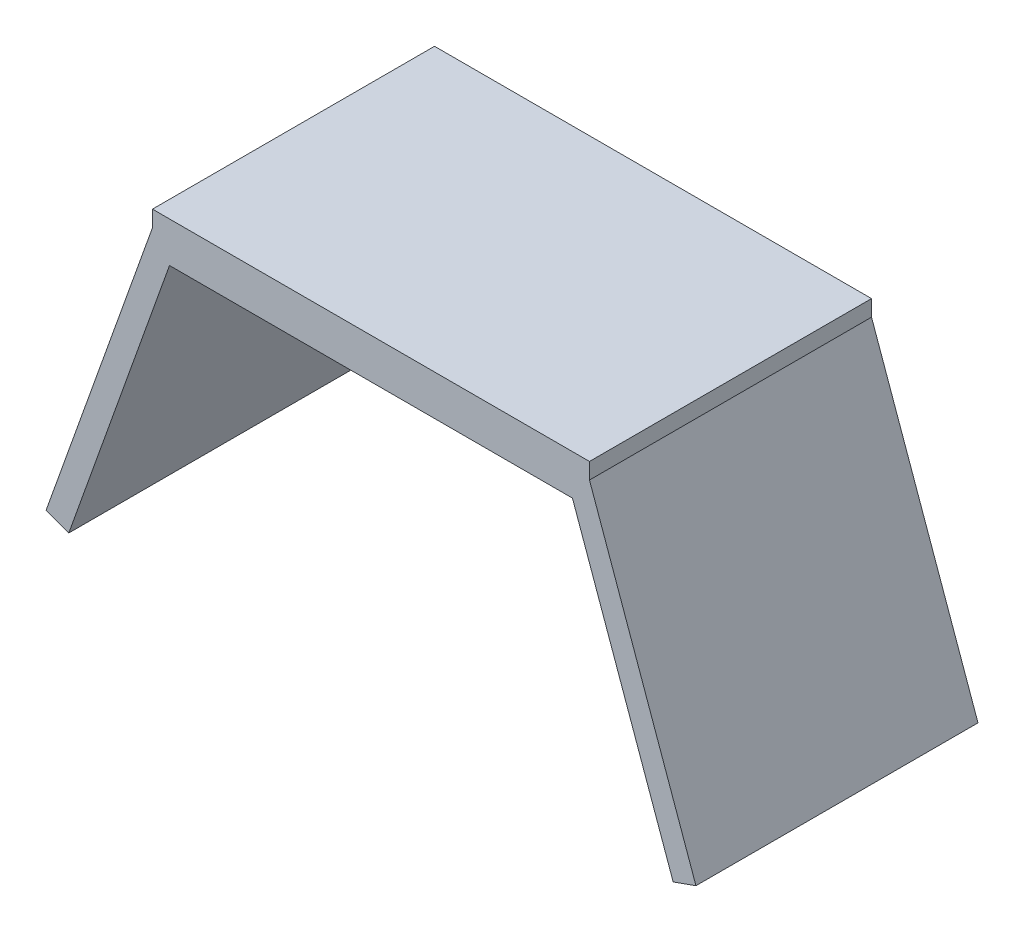
ISO-10303-21;
HEADER;
FILE_DESCRIPTION(('STEP AP214'),'2;1');
FILE_NAME('part.step','',(''),(''),'','','');
FILE_SCHEMA(('AUTOMOTIVE_DESIGN { 1 0 10303 214 1 1 1 1 }'));
ENDSEC;
DATA;
#1=APPLICATION_CONTEXT('core data for automotive mechanical design processes');
#2=APPLICATION_PROTOCOL_DEFINITION('international standard','automotive_design',2000,#1);
#3=PRODUCT_CONTEXT('',#1,'mechanical');
#4=PRODUCT('Part','Part','',(#3));
#5=PRODUCT_RELATED_PRODUCT_CATEGORY('part','',(#4));
#6=PRODUCT_DEFINITION_FORMATION('','',#4);
#7=PRODUCT_DEFINITION_CONTEXT('part definition',#1,'design');
#8=PRODUCT_DEFINITION('design','',#6,#7);
#9=PRODUCT_DEFINITION_SHAPE('','',#8);
#10=(LENGTH_UNIT() NAMED_UNIT(*) SI_UNIT(.MILLI.,.METRE.));
#11=(NAMED_UNIT(*) PLANE_ANGLE_UNIT() SI_UNIT($,.RADIAN.));
#12=(NAMED_UNIT(*) SI_UNIT($,.STERADIAN.) SOLID_ANGLE_UNIT());
#13=UNCERTAINTY_MEASURE_WITH_UNIT(LENGTH_MEASURE(1.E-05),#10,'distance_accuracy_value','');
#14=(GEOMETRIC_REPRESENTATION_CONTEXT(3) GLOBAL_UNCERTAINTY_ASSIGNED_CONTEXT((#13)) GLOBAL_UNIT_ASSIGNED_CONTEXT((#10,
#11,#12)) REPRESENTATION_CONTEXT('',''));
#15=CARTESIAN_POINT('',(0.,0.,0.));
#16=DIRECTION('',(0.,0.,1.));
#17=DIRECTION('',(1.,0.,0.));
#18=AXIS2_PLACEMENT_3D('',#15,#16,#17);
#19=CARTESIAN_POINT('',(27.1141575887111,3.,35.));
#20=DIRECTION('',(-1.,0.,0.));
#21=DIRECTION('',(0.,-1.,0.));
#22=AXIS2_PLACEMENT_3D('',#19,#20,#21);
#23=PLANE('',#22);
#24=DIRECTION('',(0.,1.,0.));
#25=VECTOR('',#24,1.);
#26=CARTESIAN_POINT('',(27.1141575887111,3.,0.));
#27=LINE('',#26,#25);
#28=CARTESIAN_POINT('',(27.1141575887111,3.,0.));
#29=VERTEX_POINT('',#28);
#30=CARTESIAN_POINT('',(27.1141575887111,5.,0.));
#31=VERTEX_POINT('',#30);
#32=EDGE_CURVE('E144',#29,#31,#27,.T.);
#33=ORIENTED_EDGE('',*,*,#32,.T.);
#34=DIRECTION('',(0.,0.,-1.));
#35=VECTOR('',#34,1.);
#36=CARTESIAN_POINT('',(27.1141575887111,5.,35.));
#37=LINE('',#36,#35);
#38=CARTESIAN_POINT('',(27.1141575887111,5.,35.));
#39=VERTEX_POINT('',#38);
#40=EDGE_CURVE('E11',#39,#31,#37,.T.);
#41=ORIENTED_EDGE('',*,*,#40,.F.);
#42=DIRECTION('',(0.,1.,0.));
#43=VECTOR('',#42,1.);
#44=CARTESIAN_POINT('',(27.1141575887111,3.,35.));
#45=LINE('',#44,#43);
#46=CARTESIAN_POINT('',(27.1141575887111,3.,35.));
#47=VERTEX_POINT('',#46);
#48=EDGE_CURVE('E162',#47,#39,#45,.T.);
#49=ORIENTED_EDGE('',*,*,#48,.F.);
#50=DIRECTION('',(0.,0.,-1.));
#51=VECTOR('',#50,1.);
#52=CARTESIAN_POINT('',(27.1141575887111,3.,35.));
#53=LINE('',#52,#51);
#54=EDGE_CURVE('E140',#47,#29,#53,.T.);
#55=ORIENTED_EDGE('',*,*,#54,.T.);
#56=EDGE_LOOP('',(#33,#41,#49,#55));
#57=FACE_BOUND('',#56,.T.);
#58=ADVANCED_FACE('F36',(#57),#23,.F.);
#59=CARTESIAN_POINT('',(-27.1141575887111,5.,35.));
#60=DIRECTION('',(0.,-1.,0.));
#61=DIRECTION('',(0.,0.,-1.));
#62=AXIS2_PLACEMENT_3D('',#59,#60,#61);
#63=PLANE('',#62);
#64=DIRECTION('',(-1.,0.,0.));
#65=VECTOR('',#64,1.);
#66=CARTESIAN_POINT('',(-27.1141575887111,5.,0.));
#67=LINE('',#66,#65);
#68=CARTESIAN_POINT('',(-27.1141575887111,5.,0.));
#69=VERTEX_POINT('',#68);
#70=EDGE_CURVE('E147',#31,#69,#67,.T.);
#71=ORIENTED_EDGE('',*,*,#70,.T.);
#72=DIRECTION('',(0.,0.,-1.));
#73=VECTOR('',#72,1.);
#74=CARTESIAN_POINT('',(-27.1141575887111,5.,35.));
#75=LINE('',#74,#73);
#76=CARTESIAN_POINT('',(-27.1141575887111,5.,35.));
#77=VERTEX_POINT('',#76);
#78=EDGE_CURVE('E44',#77,#69,#75,.T.);
#79=ORIENTED_EDGE('',*,*,#78,.F.);
#80=DIRECTION('',(-1.,0.,0.));
#81=VECTOR('',#80,1.);
#82=CARTESIAN_POINT('',(-27.1141575887111,5.,35.));
#83=LINE('',#82,#81);
#84=EDGE_CURVE('E101',#39,#77,#83,.T.);
#85=ORIENTED_EDGE('',*,*,#84,.F.);
#86=ORIENTED_EDGE('',*,*,#40,.T.);
#87=EDGE_LOOP('',(#71,#79,#85,#86));
#88=FACE_BOUND('',#87,.T.);
#89=ADVANCED_FACE('F211',(#88),#63,.F.);
#90=CARTESIAN_POINT('',(-27.1141575887111,3.,35.));
#91=DIRECTION('',(1.,0.,0.));
#92=DIRECTION('',(0.,0.,-1.));
#93=AXIS2_PLACEMENT_3D('',#90,#91,#92);
#94=PLANE('',#93);
#95=DIRECTION('',(0.,-1.,0.));
#96=VECTOR('',#95,1.);
#97=CARTESIAN_POINT('',(-27.1141575887111,3.,0.));
#98=LINE('',#97,#96);
#99=CARTESIAN_POINT('',(-27.1141575887111,3.,0.));
#100=VERTEX_POINT('',#99);
#101=EDGE_CURVE('E149',#69,#100,#98,.T.);
#102=ORIENTED_EDGE('',*,*,#101,.T.);
#103=DIRECTION('',(0.,0.,-1.));
#104=VECTOR('',#103,1.);
#105=CARTESIAN_POINT('',(-27.1141575887111,3.,35.));
#106=LINE('',#105,#104);
#107=CARTESIAN_POINT('',(-27.1141575887111,3.,35.));
#108=VERTEX_POINT('',#107);
#109=EDGE_CURVE('E175',#108,#100,#106,.T.);
#110=ORIENTED_EDGE('',*,*,#109,.F.);
#111=DIRECTION('',(0.,-1.,0.));
#112=VECTOR('',#111,1.);
#113=CARTESIAN_POINT('',(-27.1141575887111,3.,35.));
#114=LINE('',#113,#112);
#115=EDGE_CURVE('E183',#77,#108,#114,.T.);
#116=ORIENTED_EDGE('',*,*,#115,.F.);
#117=ORIENTED_EDGE('',*,*,#78,.T.);
#118=EDGE_LOOP('',(#102,#110,#116,#117));
#119=FACE_BOUND('',#118,.T.);
#120=ADVANCED_FACE('F181',(#119),#94,.F.);
#121=CARTESIAN_POINT('',(-27.1141575887111,3.,35.));
#122=DIRECTION('',(0.941741911594838,-0.336336396998156,0.));
#123=DIRECTION('',(0.336336396998156,0.941741911594838,0.));
#124=AXIS2_PLACEMENT_3D('',#121,#122,#123);
#125=PLANE('',#124);
#126=DIRECTION('',(-0.336336396998156,-0.941741911594837,0.));
#127=VECTOR('',#126,1.);
#128=CARTESIAN_POINT('',(-27.1141575887111,3.,0.));
#129=LINE('',#128,#127);
#130=CARTESIAN_POINT('',(-40.3252257347845,-33.9909908090055,0.));
#131=VERTEX_POINT('',#130);
#132=EDGE_CURVE('E151',#100,#131,#129,.T.);
#133=ORIENTED_EDGE('',*,*,#132,.T.);
#134=DIRECTION('',(0.,0.,-1.));
#135=VECTOR('',#134,1.);
#136=CARTESIAN_POINT('',(-40.3252257347845,-33.9909908090055,35.));
#137=LINE('',#136,#135);
#138=CARTESIAN_POINT('',(-40.3252257347845,-33.9909908090055,35.));
#139=VERTEX_POINT('',#138);
#140=EDGE_CURVE('E172',#139,#131,#137,.T.);
#141=ORIENTED_EDGE('',*,*,#140,.F.);
#142=DIRECTION('',(-0.336336396998156,-0.941741911594837,0.));
#143=VECTOR('',#142,1.);
#144=CARTESIAN_POINT('',(-27.1141575887111,3.,35.));
#145=LINE('',#144,#143);
#146=EDGE_CURVE('E201',#108,#139,#145,.T.);
#147=ORIENTED_EDGE('',*,*,#146,.F.);
#148=ORIENTED_EDGE('',*,*,#109,.T.);
#149=EDGE_LOOP('',(#133,#141,#147,#148));
#150=FACE_BOUND('',#149,.T.);
#151=ADVANCED_FACE('F192',(#150),#125,.F.);
#152=CARTESIAN_POINT('',(-37.5,-35.,35.));
#153=DIRECTION('',(0.336336396998154,0.941741911594838,0.));
#154=DIRECTION('',(-0.941741911594838,0.336336396998154,0.));
#155=AXIS2_PLACEMENT_3D('',#152,#153,#154);
#156=PLANE('',#155);
#157=DIRECTION('',(0.941741911594838,-0.336336396998154,0.));
#158=VECTOR('',#157,1.);
#159=CARTESIAN_POINT('',(-37.5,-35.,0.));
#160=LINE('',#159,#158);
#161=CARTESIAN_POINT('',(-37.5,-35.,0.));
#162=VERTEX_POINT('',#161);
#163=EDGE_CURVE('E153',#131,#162,#160,.T.);
#164=ORIENTED_EDGE('',*,*,#163,.T.);
#165=DIRECTION('',(0.,0.,-1.));
#166=VECTOR('',#165,1.);
#167=CARTESIAN_POINT('',(-37.5,-35.,35.));
#168=LINE('',#167,#166);
#169=CARTESIAN_POINT('',(-37.5,-35.,35.));
#170=VERTEX_POINT('',#169);
#171=EDGE_CURVE('E169',#170,#162,#168,.T.);
#172=ORIENTED_EDGE('',*,*,#171,.F.);
#173=DIRECTION('',(0.941741911594838,-0.336336396998154,0.));
#174=VECTOR('',#173,1.);
#175=CARTESIAN_POINT('',(-37.5,-35.,35.));
#176=LINE('',#175,#174);
#177=EDGE_CURVE('E198',#139,#170,#176,.T.);
#178=ORIENTED_EDGE('',*,*,#177,.F.);
#179=ORIENTED_EDGE('',*,*,#140,.T.);
#180=EDGE_LOOP('',(#164,#172,#178,#179));
#181=FACE_BOUND('',#180,.T.);
#182=ADVANCED_FACE('F196',(#181),#156,.F.);
#183=CARTESIAN_POINT('',(-25.,0.,35.));
#184=DIRECTION('',(-0.941741911594838,0.336336396998156,0.));
#185=DIRECTION('',(-0.336336396998156,-0.941741911594838,0.));
#186=AXIS2_PLACEMENT_3D('',#183,#184,#185);
#187=PLANE('',#186);
#188=DIRECTION('',(0.336336396998156,0.941741911594838,0.));
#189=VECTOR('',#188,1.);
#190=CARTESIAN_POINT('',(-25.,0.,0.));
#191=LINE('',#190,#189);
#192=CARTESIAN_POINT('',(-25.,0.,0.));
#193=VERTEX_POINT('',#192);
#194=EDGE_CURVE('E155',#162,#193,#191,.T.);
#195=ORIENTED_EDGE('',*,*,#194,.T.);
#196=DIRECTION('',(0.,0.,-1.));
#197=VECTOR('',#196,1.);
#198=CARTESIAN_POINT('',(-25.,0.,35.));
#199=LINE('',#198,#197);
#200=CARTESIAN_POINT('',(-25.,0.,35.));
#201=VERTEX_POINT('',#200);
#202=EDGE_CURVE('E166',#201,#193,#199,.T.);
#203=ORIENTED_EDGE('',*,*,#202,.F.);
#204=DIRECTION('',(0.336336396998156,0.941741911594838,0.));
#205=VECTOR('',#204,1.);
#206=CARTESIAN_POINT('',(-25.,0.,35.));
#207=LINE('',#206,#205);
#208=EDGE_CURVE('E200',#170,#201,#207,.T.);
#209=ORIENTED_EDGE('',*,*,#208,.F.);
#210=ORIENTED_EDGE('',*,*,#171,.T.);
#211=EDGE_LOOP('',(#195,#203,#209,#210));
#212=FACE_BOUND('',#211,.T.);
#213=ADVANCED_FACE('F223',(#212),#187,.F.);
#214=CARTESIAN_POINT('',(-25.,0.,35.));
#215=DIRECTION('',(0.,1.,0.));
#216=DIRECTION('',(0.,0.,1.));
#217=AXIS2_PLACEMENT_3D('',#214,#215,#216);
#218=PLANE('',#217);
#219=DIRECTION('',(1.,0.,0.));
#220=VECTOR('',#219,1.);
#221=CARTESIAN_POINT('',(-25.,0.,0.));
#222=LINE('',#221,#220);
#223=CARTESIAN_POINT('',(25.,0.,0.));
#224=VERTEX_POINT('',#223);
#225=EDGE_CURVE('E157',#193,#224,#222,.T.);
#226=ORIENTED_EDGE('',*,*,#225,.T.);
#227=DIRECTION('',(0.,0.,-1.));
#228=VECTOR('',#227,1.);
#229=CARTESIAN_POINT('',(25.,0.,35.));
#230=LINE('',#229,#228);
#231=CARTESIAN_POINT('',(25.,0.,35.));
#232=VERTEX_POINT('',#231);
#233=EDGE_CURVE('E135',#232,#224,#230,.T.);
#234=ORIENTED_EDGE('',*,*,#233,.F.);
#235=DIRECTION('',(1.,0.,0.));
#236=VECTOR('',#235,1.);
#237=CARTESIAN_POINT('',(-25.,0.,35.));
#238=LINE('',#237,#236);
#239=EDGE_CURVE('E126',#201,#232,#238,.T.);
#240=ORIENTED_EDGE('',*,*,#239,.F.);
#241=ORIENTED_EDGE('',*,*,#202,.T.);
#242=EDGE_LOOP('',(#226,#234,#240,#241));
#243=FACE_BOUND('',#242,.T.);
#244=ADVANCED_FACE('F226',(#243),#218,.F.);
#245=CARTESIAN_POINT('',(25.,0.,35.));
#246=DIRECTION('',(0.941741911594838,0.336336396998156,0.));
#247=DIRECTION('',(-0.336336396998156,0.941741911594838,0.));
#248=AXIS2_PLACEMENT_3D('',#245,#246,#247);
#249=PLANE('',#248);
#250=DIRECTION('',(0.336336396998156,-0.941741911594838,0.));
#251=VECTOR('',#250,1.);
#252=CARTESIAN_POINT('',(25.,0.,0.));
#253=LINE('',#252,#251);
#254=CARTESIAN_POINT('',(37.5,-35.,0.));
#255=VERTEX_POINT('',#254);
#256=EDGE_CURVE('E134',#224,#255,#253,.T.);
#257=ORIENTED_EDGE('',*,*,#256,.T.);
#258=DIRECTION('',(0.,0.,-1.));
#259=VECTOR('',#258,1.);
#260=CARTESIAN_POINT('',(37.5,-35.,35.));
#261=LINE('',#260,#259);
#262=CARTESIAN_POINT('',(37.5,-35.,35.));
#263=VERTEX_POINT('',#262);
#264=EDGE_CURVE('E131',#263,#255,#261,.T.);
#265=ORIENTED_EDGE('',*,*,#264,.F.);
#266=DIRECTION('',(0.336336396998156,-0.941741911594838,0.));
#267=VECTOR('',#266,1.);
#268=CARTESIAN_POINT('',(25.,0.,35.));
#269=LINE('',#268,#267);
#270=EDGE_CURVE('E120',#232,#263,#269,.T.);
#271=ORIENTED_EDGE('',*,*,#270,.F.);
#272=ORIENTED_EDGE('',*,*,#233,.T.);
#273=EDGE_LOOP('',(#257,#265,#271,#272));
#274=FACE_BOUND('',#273,.T.);
#275=ADVANCED_FACE('F132',(#274),#249,.F.);
#276=CARTESIAN_POINT('',(37.5,-35.,35.));
#277=DIRECTION('',(-0.336336396998153,0.941741911594838,0.));
#278=DIRECTION('',(-0.941741911594838,-0.336336396998153,0.));
#279=AXIS2_PLACEMENT_3D('',#276,#277,#278);
#280=PLANE('',#279);
#281=DIRECTION('',(0.941741911594838,0.336336396998153,0.));
#282=VECTOR('',#281,1.);
#283=CARTESIAN_POINT('',(37.5,-35.,0.));
#284=LINE('',#283,#282);
#285=CARTESIAN_POINT('',(40.3252257347845,-33.9909908090055,0.));
#286=VERTEX_POINT('',#285);
#287=EDGE_CURVE('E87',#255,#286,#284,.T.);
#288=ORIENTED_EDGE('',*,*,#287,.T.);
#289=DIRECTION('',(0.,0.,-1.));
#290=VECTOR('',#289,1.);
#291=CARTESIAN_POINT('',(40.3252257347845,-33.9909908090055,35.));
#292=LINE('',#291,#290);
#293=CARTESIAN_POINT('',(40.3252257347845,-33.9909908090055,35.));
#294=VERTEX_POINT('',#293);
#295=EDGE_CURVE('E136',#294,#286,#292,.T.);
#296=ORIENTED_EDGE('',*,*,#295,.F.);
#297=DIRECTION('',(0.941741911594838,0.336336396998153,0.));
#298=VECTOR('',#297,1.);
#299=CARTESIAN_POINT('',(37.5,-35.,35.));
#300=LINE('',#299,#298);
#301=EDGE_CURVE('E124',#263,#294,#300,.T.);
#302=ORIENTED_EDGE('',*,*,#301,.F.);
#303=ORIENTED_EDGE('',*,*,#264,.T.);
#304=EDGE_LOOP('',(#288,#296,#302,#303));
#305=FACE_BOUND('',#304,.T.);
#306=ADVANCED_FACE('F138',(#305),#280,.F.);
#307=CARTESIAN_POINT('',(27.1141575887111,3.,35.));
#308=DIRECTION('',(-0.941741911594838,-0.336336396998156,0.));
#309=DIRECTION('',(0.336336396998156,-0.941741911594838,0.));
#310=AXIS2_PLACEMENT_3D('',#307,#308,#309);
#311=PLANE('',#310);
#312=DIRECTION('',(-0.336336396998156,0.941741911594837,0.));
#313=VECTOR('',#312,1.);
#314=CARTESIAN_POINT('',(27.1141575887111,3.,0.));
#315=LINE('',#314,#313);
#316=EDGE_CURVE('E93',#286,#29,#315,.T.);
#317=ORIENTED_EDGE('',*,*,#316,.T.);
#318=ORIENTED_EDGE('',*,*,#54,.F.);
#319=DIRECTION('',(-0.336336396998156,0.941741911594837,0.));
#320=VECTOR('',#319,1.);
#321=CARTESIAN_POINT('',(27.1141575887111,3.,35.));
#322=LINE('',#321,#320);
#323=EDGE_CURVE('E52',#294,#47,#322,.T.);
#324=ORIENTED_EDGE('',*,*,#323,.F.);
#325=ORIENTED_EDGE('',*,*,#295,.T.);
#326=EDGE_LOOP('',(#317,#318,#324,#325));
#327=FACE_BOUND('',#326,.T.);
#328=ADVANCED_FACE('F235',(#327),#311,.F.);
#329=CARTESIAN_POINT('',(0.,0.,35.));
#330=DIRECTION('',(0.,0.,-1.));
#331=DIRECTION('',(-1.,0.,0.));
#332=AXIS2_PLACEMENT_3D('',#329,#330,#331);
#333=PLANE('',#332);
#334=ORIENTED_EDGE('',*,*,#48,.T.);
#335=ORIENTED_EDGE('',*,*,#84,.T.);
#336=ORIENTED_EDGE('',*,*,#115,.T.);
#337=ORIENTED_EDGE('',*,*,#146,.T.);
#338=ORIENTED_EDGE('',*,*,#177,.T.);
#339=ORIENTED_EDGE('',*,*,#208,.T.);
#340=ORIENTED_EDGE('',*,*,#239,.T.);
#341=ORIENTED_EDGE('',*,*,#270,.T.);
#342=ORIENTED_EDGE('',*,*,#301,.T.);
#343=ORIENTED_EDGE('',*,*,#323,.T.);
#344=EDGE_LOOP('',(#334,#335,#336,#337,#338,#339,#340,#341,#342,#343));
#345=FACE_BOUND('',#344,.T.);
#346=ADVANCED_FACE('F122',(#345),#333,.F.);
#347=CARTESIAN_POINT('',(0.,0.,0.));
#348=DIRECTION('',(0.,0.,-1.));
#349=DIRECTION('',(-1.,0.,0.));
#350=AXIS2_PLACEMENT_3D('',#347,#348,#349);
#351=PLANE('',#350);
#352=ORIENTED_EDGE('',*,*,#32,.F.);
#353=ORIENTED_EDGE('',*,*,#316,.F.);
#354=ORIENTED_EDGE('',*,*,#287,.F.);
#355=ORIENTED_EDGE('',*,*,#256,.F.);
#356=ORIENTED_EDGE('',*,*,#225,.F.);
#357=ORIENTED_EDGE('',*,*,#194,.F.);
#358=ORIENTED_EDGE('',*,*,#163,.F.);
#359=ORIENTED_EDGE('',*,*,#132,.F.);
#360=ORIENTED_EDGE('',*,*,#101,.F.);
#361=ORIENTED_EDGE('',*,*,#70,.F.);
#362=EDGE_LOOP('',(#352,#353,#354,#355,#356,#357,#358,#359,#360,#361));
#363=FACE_BOUND('',#362,.T.);
#364=ADVANCED_FACE('F187',(#363),#351,.T.);
#365=CLOSED_SHELL('',(#58,#89,#120,#151,#182,#213,#244,#275,#306,#328,#346,#364));
#366=MANIFOLD_SOLID_BREP('B2',#365);
#367=ADVANCED_BREP_SHAPE_REPRESENTATION('',(#18,#366),#14);
#368=SHAPE_DEFINITION_REPRESENTATION(#9,#367);
ENDSEC;
END-ISO-10303-21;
